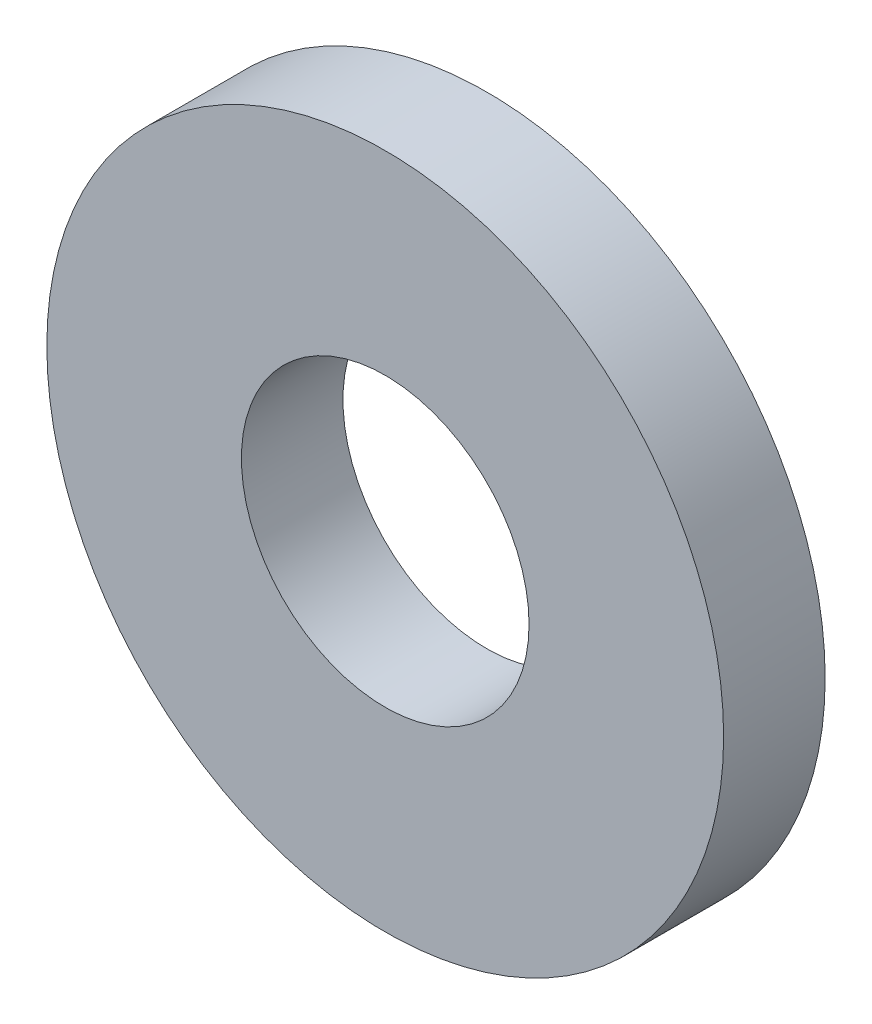
ISO-10303-21;
HEADER;
FILE_DESCRIPTION(('STEP AP214'),'2;1');
FILE_NAME('part.step','',(''),(''),'','','');
FILE_SCHEMA(('AUTOMOTIVE_DESIGN { 1 0 10303 214 1 1 1 1 }'));
ENDSEC;
DATA;
#1=APPLICATION_CONTEXT('core data for automotive mechanical design processes');
#2=APPLICATION_PROTOCOL_DEFINITION('international standard','automotive_design',2000,#1);
#3=PRODUCT_CONTEXT('',#1,'mechanical');
#4=PRODUCT('Part','Part','',(#3));
#5=PRODUCT_RELATED_PRODUCT_CATEGORY('part','',(#4));
#6=PRODUCT_DEFINITION_FORMATION('','',#4);
#7=PRODUCT_DEFINITION_CONTEXT('part definition',#1,'design');
#8=PRODUCT_DEFINITION('design','',#6,#7);
#9=PRODUCT_DEFINITION_SHAPE('','',#8);
#10=(LENGTH_UNIT() NAMED_UNIT(*) SI_UNIT(.MILLI.,.METRE.));
#11=(NAMED_UNIT(*) PLANE_ANGLE_UNIT() SI_UNIT($,.RADIAN.));
#12=(NAMED_UNIT(*) SI_UNIT($,.STERADIAN.) SOLID_ANGLE_UNIT());
#13=UNCERTAINTY_MEASURE_WITH_UNIT(LENGTH_MEASURE(1.E-05),#10,'distance_accuracy_value','');
#14=(GEOMETRIC_REPRESENTATION_CONTEXT(3) GLOBAL_UNCERTAINTY_ASSIGNED_CONTEXT((#13)) GLOBAL_UNIT_ASSIGNED_CONTEXT((#10,
#11,#12)) REPRESENTATION_CONTEXT('',''));
#15=CARTESIAN_POINT('',(0.,0.,0.));
#16=DIRECTION('',(0.,0.,1.));
#17=DIRECTION('',(1.,0.,0.));
#18=AXIS2_PLACEMENT_3D('',#15,#16,#17);
#19=CARTESIAN_POINT('',(349.999999999999,80.,6.00000000000001));
#20=DIRECTION('',(0.,0.,1.));
#21=DIRECTION('',(1.,0.,0.));
#22=AXIS2_PLACEMENT_3D('',#19,#20,#21);
#23=PLANE('',#22);
#24=CARTESIAN_POINT('',(349.999999999999,80.,6.00000000000001));
#25=DIRECTION('',(0.,0.,1.));
#26=DIRECTION('',(1.,0.,0.));
#27=AXIS2_PLACEMENT_3D('',#24,#25,#26);
#28=CIRCLE('',#27,20.);
#29=CARTESIAN_POINT('',(369.999999999999,80.,6.00000000000001));
#30=VERTEX_POINT('',#29);
#31=EDGE_CURVE('E10',#30,#30,#28,.T.);
#32=ORIENTED_EDGE('',*,*,#31,.T.);
#33=EDGE_LOOP('',(#32));
#34=FACE_BOUND('',#33,.T.);
#35=CARTESIAN_POINT('',(349.999999999999,80.,6.00000000000001));
#36=DIRECTION('',(0.,0.,1.));
#37=DIRECTION('',(1.,0.,0.));
#38=AXIS2_PLACEMENT_3D('',#35,#36,#37);
#39=CIRCLE('',#38,8.50000000000001);
#40=CARTESIAN_POINT('',(358.499999999999,80.,6.00000000000001));
#41=VERTEX_POINT('',#40);
#42=EDGE_CURVE('E51',#41,#41,#39,.T.);
#43=ORIENTED_EDGE('',*,*,#42,.F.);
#44=EDGE_LOOP('',(#43));
#45=FACE_BOUND('',#44,.T.);
#46=ADVANCED_FACE('F36',(#34,#45),#23,.T.);
#47=CARTESIAN_POINT('',(349.999999999999,80.,0.));
#48=DIRECTION('',(0.,0.,1.));
#49=DIRECTION('',(1.,0.,0.));
#50=AXIS2_PLACEMENT_3D('',#47,#48,#49);
#51=PLANE('',#50);
#52=CARTESIAN_POINT('',(349.999999999999,80.,0.));
#53=DIRECTION('',(0.,0.,1.));
#54=DIRECTION('',(1.,0.,0.));
#55=AXIS2_PLACEMENT_3D('',#52,#53,#54);
#56=CIRCLE('',#55,20.);
#57=CARTESIAN_POINT('',(369.999999999999,80.,0.));
#58=VERTEX_POINT('',#57);
#59=EDGE_CURVE('E40',#58,#58,#56,.T.);
#60=ORIENTED_EDGE('',*,*,#59,.F.);
#61=EDGE_LOOP('',(#60));
#62=FACE_BOUND('',#61,.T.);
#63=CARTESIAN_POINT('',(349.999999999999,80.,0.));
#64=DIRECTION('',(0.,0.,1.));
#65=DIRECTION('',(1.,0.,0.));
#66=AXIS2_PLACEMENT_3D('',#63,#64,#65);
#67=CIRCLE('',#66,8.50000000000001);
#68=CARTESIAN_POINT('',(358.499999999999,80.,0.));
#69=VERTEX_POINT('',#68);
#70=EDGE_CURVE('E53',#69,#69,#67,.T.);
#71=ORIENTED_EDGE('',*,*,#70,.T.);
#72=EDGE_LOOP('',(#71));
#73=FACE_BOUND('',#72,.T.);
#74=ADVANCED_FACE('F63',(#62,#73),#51,.F.);
#75=CARTESIAN_POINT('',(349.999999999999,80.,6.00000000000001));
#76=DIRECTION('',(0.,0.,-1.));
#77=DIRECTION('',(-1.,0.,0.));
#78=AXIS2_PLACEMENT_3D('',#75,#76,#77);
#79=CYLINDRICAL_SURFACE('',#78,20.);
#80=ORIENTED_EDGE('',*,*,#31,.F.);
#81=EDGE_LOOP('',(#80));
#82=FACE_BOUND('',#81,.T.);
#83=ORIENTED_EDGE('',*,*,#59,.T.);
#84=EDGE_LOOP('',(#83));
#85=FACE_BOUND('',#84,.T.);
#86=ADVANCED_FACE('F38',(#82,#85),#79,.T.);
#87=CARTESIAN_POINT('',(349.999999999999,80.,6.00000000000001));
#88=DIRECTION('',(0.,0.,-1.));
#89=DIRECTION('',(-1.,0.,0.));
#90=AXIS2_PLACEMENT_3D('',#87,#88,#89);
#91=CYLINDRICAL_SURFACE('',#90,8.50000000000001);
#92=ORIENTED_EDGE('',*,*,#42,.T.);
#93=EDGE_LOOP('',(#92));
#94=FACE_BOUND('',#93,.T.);
#95=ORIENTED_EDGE('',*,*,#70,.F.);
#96=EDGE_LOOP('',(#95));
#97=FACE_BOUND('',#96,.T.);
#98=ADVANCED_FACE('F59',(#94,#97),#91,.F.);
#99=CLOSED_SHELL('',(#46,#74,#86,#98));
#100=MANIFOLD_SOLID_BREP('B2',#99);
#101=ADVANCED_BREP_SHAPE_REPRESENTATION('',(#18,#100),#14);
#102=SHAPE_DEFINITION_REPRESENTATION(#9,#101);
ENDSEC;
END-ISO-10303-21;
